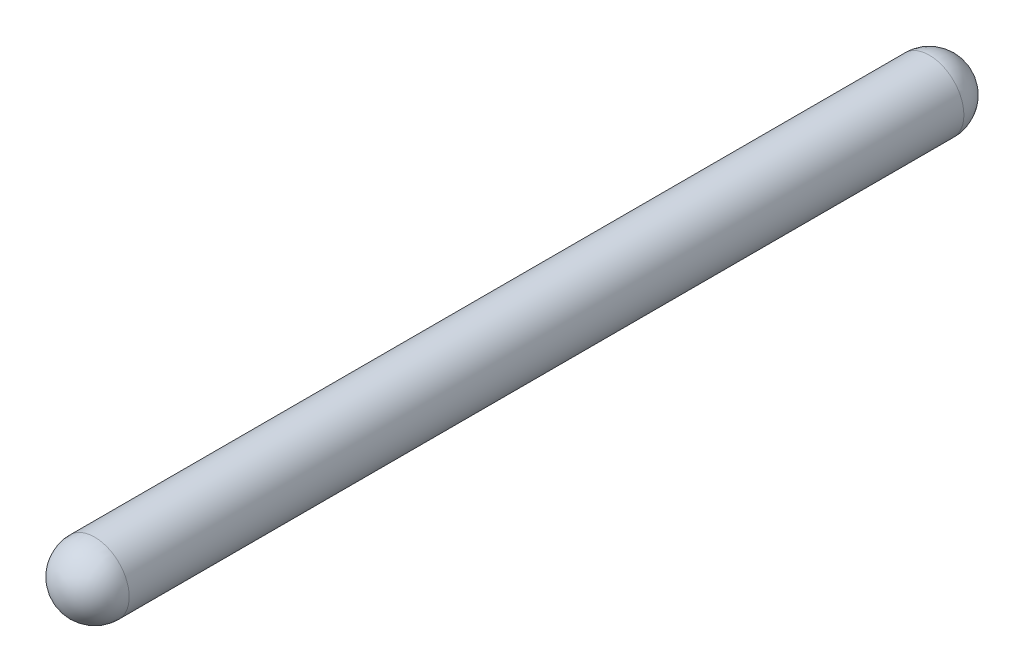
ISO-10303-21;
HEADER;
FILE_DESCRIPTION(('STEP AP214'),'2;1');
FILE_NAME('part.step','',(''),(''),'','','');
FILE_SCHEMA(('AUTOMOTIVE_DESIGN { 1 0 10303 214 1 1 1 1 }'));
ENDSEC;
DATA;
#1=APPLICATION_CONTEXT('core data for automotive mechanical design processes');
#2=APPLICATION_PROTOCOL_DEFINITION('international standard','automotive_design',2000,#1);
#3=PRODUCT_CONTEXT('',#1,'mechanical');
#4=PRODUCT('Part','Part','',(#3));
#5=PRODUCT_RELATED_PRODUCT_CATEGORY('part','',(#4));
#6=PRODUCT_DEFINITION_FORMATION('','',#4);
#7=PRODUCT_DEFINITION_CONTEXT('part definition',#1,'design');
#8=PRODUCT_DEFINITION('design','',#6,#7);
#9=PRODUCT_DEFINITION_SHAPE('','',#8);
#10=(LENGTH_UNIT() NAMED_UNIT(*) SI_UNIT(.MILLI.,.METRE.));
#11=(NAMED_UNIT(*) PLANE_ANGLE_UNIT() SI_UNIT($,.RADIAN.));
#12=(NAMED_UNIT(*) SI_UNIT($,.STERADIAN.) SOLID_ANGLE_UNIT());
#13=UNCERTAINTY_MEASURE_WITH_UNIT(LENGTH_MEASURE(1.E-05),#10,'distance_accuracy_value','');
#14=(GEOMETRIC_REPRESENTATION_CONTEXT(3) GLOBAL_UNCERTAINTY_ASSIGNED_CONTEXT((#13)) GLOBAL_UNIT_ASSIGNED_CONTEXT((#10,
#11,#12)) REPRESENTATION_CONTEXT('',''));
#15=CARTESIAN_POINT('',(0.,0.,0.));
#16=DIRECTION('',(0.,0.,1.));
#17=DIRECTION('',(1.,0.,0.));
#18=AXIS2_PLACEMENT_3D('',#15,#16,#17);
#19=CARTESIAN_POINT('',(1.27,0.,-3.));
#20=DIRECTION('',(1.,0.,0.));
#21=DIRECTION('',(0.,-1.,0.));
#22=AXIS2_PLACEMENT_3D('',#19,#20,#21);
#23=SPHERICAL_SURFACE('',#22,0.331);
#24=CARTESIAN_POINT('',(1.27,0.,-3.));
#25=DIRECTION('',(0.,0.,1.));
#26=DIRECTION('',(1.,0.,0.));
#27=AXIS2_PLACEMENT_3D('',#24,#25,#26);
#28=CIRCLE('',#27,0.331);
#29=CARTESIAN_POINT('',(1.601,0.,-3.));
#30=VERTEX_POINT('',#29);
#31=CARTESIAN_POINT('',(0.939,0.,-3.));
#32=VERTEX_POINT('',#31);
#33=EDGE_CURVE('E42',#30,#32,#28,.T.);
#34=ORIENTED_EDGE('',*,*,#33,.F.);
#35=CARTESIAN_POINT('',(1.27,0.,-3.));
#36=DIRECTION('',(0.,0.,1.));
#37=DIRECTION('',(1.,0.,0.));
#38=AXIS2_PLACEMENT_3D('',#35,#36,#37);
#39=CIRCLE('',#38,0.331);
#40=EDGE_CURVE('E26',#32,#30,#39,.T.);
#41=ORIENTED_EDGE('',*,*,#40,.F.);
#42=EDGE_LOOP('',(#34,#41));
#43=FACE_BOUND('',#42,.T.);
#44=ADVANCED_FACE('F17',(#43),#23,.T.);
#45=CARTESIAN_POINT('',(1.27,0.,5.));
#46=DIRECTION('',(1.,0.,0.));
#47=DIRECTION('',(0.,1.,0.));
#48=AXIS2_PLACEMENT_3D('',#45,#46,#47);
#49=SPHERICAL_SURFACE('',#48,0.331);
#50=CARTESIAN_POINT('',(1.27,0.,5.));
#51=DIRECTION('',(0.,0.,1.));
#52=DIRECTION('',(1.,0.,0.));
#53=AXIS2_PLACEMENT_3D('',#50,#51,#52);
#54=CIRCLE('',#53,0.331);
#55=CARTESIAN_POINT('',(1.601,0.,5.));
#56=VERTEX_POINT('',#55);
#57=CARTESIAN_POINT('',(0.939,0.,5.));
#58=VERTEX_POINT('',#57);
#59=EDGE_CURVE('E11',#56,#58,#54,.F.);
#60=ORIENTED_EDGE('',*,*,#59,.F.);
#61=CARTESIAN_POINT('',(1.27,0.,5.));
#62=DIRECTION('',(0.,0.,1.));
#63=DIRECTION('',(1.,0.,0.));
#64=AXIS2_PLACEMENT_3D('',#61,#62,#63);
#65=CIRCLE('',#64,0.331);
#66=EDGE_CURVE('E34',#58,#56,#65,.F.);
#67=ORIENTED_EDGE('',*,*,#66,.F.);
#68=EDGE_LOOP('',(#60,#67));
#69=FACE_BOUND('',#68,.T.);
#70=ADVANCED_FACE('F49',(#69),#49,.T.);
#71=CARTESIAN_POINT('',(1.27,0.,-3.));
#72=DIRECTION('',(0.,0.,1.));
#73=DIRECTION('',(1.,0.,0.));
#74=AXIS2_PLACEMENT_3D('',#71,#72,#73);
#75=CYLINDRICAL_SURFACE('',#74,0.331);
#76=ORIENTED_EDGE('',*,*,#66,.T.);
#77=ORIENTED_EDGE('',*,*,#59,.T.);
#78=EDGE_LOOP('',(#76,#77));
#79=FACE_BOUND('',#78,.T.);
#80=ORIENTED_EDGE('',*,*,#40,.T.);
#81=ORIENTED_EDGE('',*,*,#33,.T.);
#82=EDGE_LOOP('',(#80,#81));
#83=FACE_BOUND('',#82,.T.);
#84=ADVANCED_FACE('F45',(#79,#83),#75,.T.);
#85=CLOSED_SHELL('',(#44,#70,#84));
#86=MANIFOLD_SOLID_BREP('B1',#85);
#87=ADVANCED_BREP_SHAPE_REPRESENTATION('',(#18,#86),#14);
#88=SHAPE_DEFINITION_REPRESENTATION(#9,#87);
ENDSEC;
END-ISO-10303-21;
